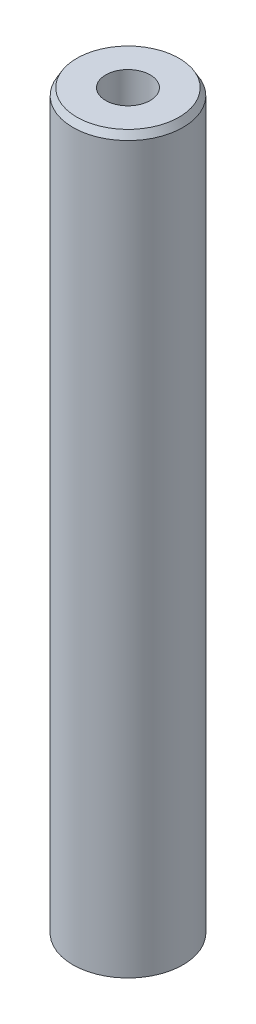
ISO-10303-21;
HEADER;
FILE_DESCRIPTION(('STEP AP214'),'2;1');
FILE_NAME('part.step','',(''),(''),'','','');
FILE_SCHEMA(('AUTOMOTIVE_DESIGN { 1 0 10303 214 1 1 1 1 }'));
ENDSEC;
DATA;
#1=APPLICATION_CONTEXT('core data for automotive mechanical design processes');
#2=APPLICATION_PROTOCOL_DEFINITION('international standard','automotive_design',2000,#1);
#3=PRODUCT_CONTEXT('',#1,'mechanical');
#4=PRODUCT('Part','Part','',(#3));
#5=PRODUCT_RELATED_PRODUCT_CATEGORY('part','',(#4));
#6=PRODUCT_DEFINITION_FORMATION('','',#4);
#7=PRODUCT_DEFINITION_CONTEXT('part definition',#1,'design');
#8=PRODUCT_DEFINITION('design','',#6,#7);
#9=PRODUCT_DEFINITION_SHAPE('','',#8);
#10=(LENGTH_UNIT() NAMED_UNIT(*) SI_UNIT(.MILLI.,.METRE.));
#11=(NAMED_UNIT(*) PLANE_ANGLE_UNIT() SI_UNIT($,.RADIAN.));
#12=(NAMED_UNIT(*) SI_UNIT($,.STERADIAN.) SOLID_ANGLE_UNIT());
#13=UNCERTAINTY_MEASURE_WITH_UNIT(LENGTH_MEASURE(1.E-05),#10,'distance_accuracy_value','');
#14=(GEOMETRIC_REPRESENTATION_CONTEXT(3) GLOBAL_UNCERTAINTY_ASSIGNED_CONTEXT((#13)) GLOBAL_UNIT_ASSIGNED_CONTEXT((#10,
#11,#12)) REPRESENTATION_CONTEXT('',''));
#15=CARTESIAN_POINT('',(0.,0.,0.));
#16=DIRECTION('',(0.,0.,1.));
#17=DIRECTION('',(1.,0.,0.));
#18=AXIS2_PLACEMENT_3D('',#15,#16,#17);
#19=CARTESIAN_POINT('',(0.,133.703424018359,0.));
#20=DIRECTION('',(0.,-1.,0.));
#21=DIRECTION('',(0.,0.,-1.));
#22=AXIS2_PLACEMENT_3D('',#19,#20,#21);
#23=CYLINDRICAL_SURFACE('',#22,10.);
#24=CARTESIAN_POINT('',(0.,132.452050357293,0.));
#25=DIRECTION('',(0.,1.,0.));
#26=DIRECTION('',(0.,0.,1.));
#27=AXIS2_PLACEMENT_3D('',#24,#25,#26);
#28=CIRCLE('',#27,10.);
#29=CARTESIAN_POINT('',(0.,132.452050357293,10.));
#30=VERTEX_POINT('',#29);
#31=EDGE_CURVE('E50',#30,#30,#28,.F.);
#32=ORIENTED_EDGE('',*,*,#31,.T.);
#33=EDGE_LOOP('',(#32));
#34=FACE_BOUND('',#33,.T.);
#35=CARTESIAN_POINT('',(0.,0.722480920073709,0.));
#36=DIRECTION('',(0.,1.,0.));
#37=DIRECTION('',(0.,0.,1.));
#38=AXIS2_PLACEMENT_3D('',#35,#36,#37);
#39=CIRCLE('',#38,10.);
#40=CARTESIAN_POINT('',(0.,0.722480920073709,10.));
#41=VERTEX_POINT('',#40);
#42=EDGE_CURVE('E51',#41,#41,#39,.T.);
#43=ORIENTED_EDGE('',*,*,#42,.T.);
#44=EDGE_LOOP('',(#43));
#45=FACE_BOUND('',#44,.T.);
#46=ADVANCED_FACE('F39',(#34,#45),#23,.T.);
#47=CARTESIAN_POINT('',(0.,133.703424018359,0.));
#48=DIRECTION('',(0.,1.,0.));
#49=DIRECTION('',(0.,0.,1.));
#50=AXIS2_PLACEMENT_3D('',#47,#48,#49);
#51=PLANE('',#50);
#52=CARTESIAN_POINT('',(0.,133.703424018359,0.));
#53=DIRECTION('',(0.,1.,0.));
#54=DIRECTION('',(0.,0.,1.));
#55=AXIS2_PLACEMENT_3D('',#52,#53,#54);
#56=CIRCLE('',#55,9.27751907992629);
#57=CARTESIAN_POINT('',(0.,133.703424018359,9.27751907992629));
#58=VERTEX_POINT('',#57);
#59=EDGE_CURVE('E54',#58,#58,#56,.T.);
#60=ORIENTED_EDGE('',*,*,#59,.T.);
#61=EDGE_LOOP('',(#60));
#62=FACE_BOUND('',#61,.T.);
#63=CARTESIAN_POINT('',(0.,133.703424018359,0.));
#64=DIRECTION('',(0.,1.,0.));
#65=DIRECTION('',(0.,0.,1.));
#66=AXIS2_PLACEMENT_3D('',#63,#64,#65);
#67=CIRCLE('',#66,4.04232920514345);
#68=CARTESIAN_POINT('',(0.,133.703424018359,4.04232920514345));
#69=VERTEX_POINT('',#68);
#70=EDGE_CURVE('E58',#69,#69,#67,.T.);
#71=ORIENTED_EDGE('',*,*,#70,.F.);
#72=EDGE_LOOP('',(#71));
#73=FACE_BOUND('',#72,.T.);
#74=ADVANCED_FACE('F69',(#62,#73),#51,.T.);
#75=CARTESIAN_POINT('',(0.,0.,0.));
#76=DIRECTION('',(0.,1.,0.));
#77=DIRECTION('',(0.,0.,1.));
#78=AXIS2_PLACEMENT_3D('',#75,#76,#77);
#79=PLANE('',#78);
#80=CARTESIAN_POINT('',(0.,0.,0.));
#81=DIRECTION('',(0.,1.,0.));
#82=DIRECTION('',(0.,0.,1.));
#83=AXIS2_PLACEMENT_3D('',#80,#81,#82);
#84=CIRCLE('',#83,8.74862633893321);
#85=CARTESIAN_POINT('',(0.,0.,8.74862633893321));
#86=VERTEX_POINT('',#85);
#87=EDGE_CURVE('E10',#86,#86,#84,.F.);
#88=ORIENTED_EDGE('',*,*,#87,.T.);
#89=EDGE_LOOP('',(#88));
#90=FACE_BOUND('',#89,.T.);
#91=CARTESIAN_POINT('',(0.,0.,0.));
#92=DIRECTION('',(0.,1.,0.));
#93=DIRECTION('',(0.,0.,1.));
#94=AXIS2_PLACEMENT_3D('',#91,#92,#93);
#95=CIRCLE('',#94,4.04232920514345);
#96=CARTESIAN_POINT('',(0.,0.,4.04232920514345));
#97=VERTEX_POINT('',#96);
#98=EDGE_CURVE('E63',#97,#97,#95,.T.);
#99=ORIENTED_EDGE('',*,*,#98,.T.);
#100=EDGE_LOOP('',(#99));
#101=FACE_BOUND('',#100,.T.);
#102=ADVANCED_FACE('F75',(#90,#101),#79,.F.);
#103=CARTESIAN_POINT('',(0.,133.703424018359,0.));
#104=DIRECTION('',(0.,-1.,0.));
#105=DIRECTION('',(0.,0.,-1.));
#106=AXIS2_PLACEMENT_3D('',#103,#104,#105);
#107=CYLINDRICAL_SURFACE('',#106,4.04232920514345);
#108=ORIENTED_EDGE('',*,*,#70,.T.);
#109=EDGE_LOOP('',(#108));
#110=FACE_BOUND('',#109,.T.);
#111=ORIENTED_EDGE('',*,*,#98,.F.);
#112=EDGE_LOOP('',(#111));
#113=FACE_BOUND('',#112,.T.);
#114=ADVANCED_FACE('F70',(#110,#113),#107,.F.);
#115=CARTESIAN_POINT('',(0.,133.703424018359,0.));
#116=DIRECTION('',(0.,-1.,0.));
#117=DIRECTION('',(0.,0.,-1.));
#118=AXIS2_PLACEMENT_3D('',#115,#116,#117);
#119=CONICAL_SURFACE('',#118,9.27751907992629,0.523598775598298);
#120=ORIENTED_EDGE('',*,*,#31,.F.);
#121=EDGE_LOOP('',(#120));
#122=FACE_BOUND('',#121,.T.);
#123=ORIENTED_EDGE('',*,*,#59,.F.);
#124=EDGE_LOOP('',(#123));
#125=FACE_BOUND('',#124,.T.);
#126=ADVANCED_FACE('F81',(#122,#125),#119,.T.);
#127=CARTESIAN_POINT('',(0.,0.722480920073709,0.));
#128=DIRECTION('',(0.,1.,0.));
#129=DIRECTION('',(0.,0.,1.));
#130=AXIS2_PLACEMENT_3D('',#127,#128,#129);
#131=CONICAL_SURFACE('',#130,10.,1.0471975511966);
#132=ORIENTED_EDGE('',*,*,#87,.F.);
#133=EDGE_LOOP('',(#132));
#134=FACE_BOUND('',#133,.T.);
#135=ORIENTED_EDGE('',*,*,#42,.F.);
#136=EDGE_LOOP('',(#135));
#137=FACE_BOUND('',#136,.T.);
#138=ADVANCED_FACE('F45',(#134,#137),#131,.T.);
#139=CLOSED_SHELL('',(#46,#74,#102,#114,#126,#138));
#140=MANIFOLD_SOLID_BREP('B2',#139);
#141=ADVANCED_BREP_SHAPE_REPRESENTATION('',(#18,#140),#14);
#142=SHAPE_DEFINITION_REPRESENTATION(#9,#141);
ENDSEC;
END-ISO-10303-21;
